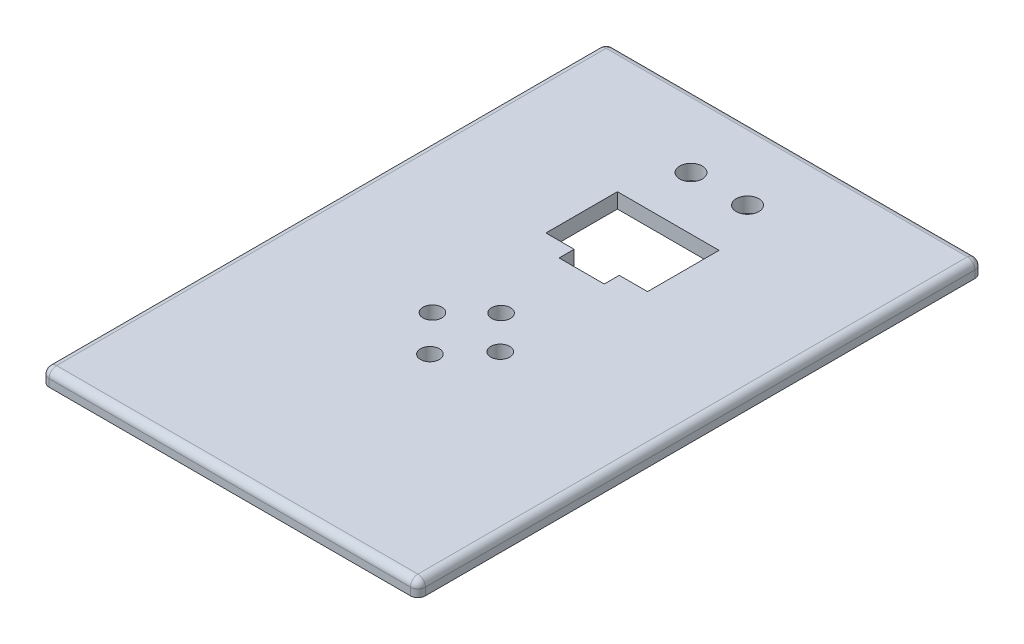
ISO-10303-21;
HEADER;
FILE_DESCRIPTION(('STEP AP214'),'2;1');
FILE_NAME('part.step','',(''),(''),'','','');
FILE_SCHEMA(('AUTOMOTIVE_DESIGN { 1 0 10303 214 1 1 1 1 }'));
ENDSEC;
DATA;
#1=APPLICATION_CONTEXT('core data for automotive mechanical design processes');
#2=APPLICATION_PROTOCOL_DEFINITION('international standard','automotive_design',2000,#1);
#3=PRODUCT_CONTEXT('',#1,'mechanical');
#4=PRODUCT('Part','Part','',(#3));
#5=PRODUCT_RELATED_PRODUCT_CATEGORY('part','',(#4));
#6=PRODUCT_DEFINITION_FORMATION('','',#4);
#7=PRODUCT_DEFINITION_CONTEXT('part definition',#1,'design');
#8=PRODUCT_DEFINITION('design','',#6,#7);
#9=PRODUCT_DEFINITION_SHAPE('','',#8);
#10=(LENGTH_UNIT() NAMED_UNIT(*) SI_UNIT(.MILLI.,.METRE.));
#11=(NAMED_UNIT(*) PLANE_ANGLE_UNIT() SI_UNIT($,.RADIAN.));
#12=(NAMED_UNIT(*) SI_UNIT($,.STERADIAN.) SOLID_ANGLE_UNIT());
#13=UNCERTAINTY_MEASURE_WITH_UNIT(LENGTH_MEASURE(1.E-05),#10,'distance_accuracy_value','');
#14=(GEOMETRIC_REPRESENTATION_CONTEXT(3) GLOBAL_UNCERTAINTY_ASSIGNED_CONTEXT((#13)) GLOBAL_UNIT_ASSIGNED_CONTEXT((#10,
#11,#12)) REPRESENTATION_CONTEXT('',''));
#15=CARTESIAN_POINT('',(0.,0.,0.));
#16=DIRECTION('',(0.,0.,1.));
#17=DIRECTION('',(1.,0.,0.));
#18=AXIS2_PLACEMENT_3D('',#15,#16,#17);
#19=CARTESIAN_POINT('',(0.,4.,0.));
#20=DIRECTION('',(0.,1.,0.));
#21=DIRECTION('',(0.,0.,1.));
#22=AXIS2_PLACEMENT_3D('',#19,#20,#21);
#23=PLANE('',#22);
#24=DIRECTION('',(0.,0.,-1.));
#25=VECTOR('',#24,1.);
#26=CARTESIAN_POINT('',(2.,4.,0.));
#27=LINE('',#26,#25);
#28=CARTESIAN_POINT('',(1.99999999999999,4.,-148.));
#29=VERTEX_POINT('',#28);
#30=CARTESIAN_POINT('',(2.,4.,-2.));
#31=VERTEX_POINT('',#30);
#32=EDGE_CURVE('E251',#29,#31,#27,.F.);
#33=ORIENTED_EDGE('',*,*,#32,.T.);
#34=DIRECTION('',(1.,0.,0.));
#35=VECTOR('',#34,1.);
#36=CARTESIAN_POINT('',(100.,4.,-2.));
#37=LINE('',#36,#35);
#38=CARTESIAN_POINT('',(98.,4.,-2.));
#39=VERTEX_POINT('',#38);
#40=EDGE_CURVE('E255',#31,#39,#37,.T.);
#41=ORIENTED_EDGE('',*,*,#40,.T.);
#42=DIRECTION('',(0.,0.,-1.));
#43=VECTOR('',#42,1.);
#44=CARTESIAN_POINT('',(98.,4.,-150.));
#45=LINE('',#44,#43);
#46=CARTESIAN_POINT('',(98.,4.,-148.));
#47=VERTEX_POINT('',#46);
#48=EDGE_CURVE('E253',#39,#47,#45,.T.);
#49=ORIENTED_EDGE('',*,*,#48,.T.);
#50=DIRECTION('',(1.,0.,0.));
#51=VECTOR('',#50,1.);
#52=CARTESIAN_POINT('',(0.,4.,-148.));
#53=LINE('',#52,#51);
#54=EDGE_CURVE('E249',#47,#29,#53,.F.);
#55=ORIENTED_EDGE('',*,*,#54,.T.);
#56=EDGE_LOOP('',(#33,#41,#49,#55));
#57=FACE_BOUND('',#56,.T.);
#58=CARTESIAN_POINT('',(56.881630687076,4.,-130.696209526068));
#59=DIRECTION('',(0.,1.,0.));
#60=DIRECTION('',(0.,0.,1.));
#61=AXIS2_PLACEMENT_3D('',#58,#59,#60);
#62=CIRCLE('',#61,3.);
#63=CARTESIAN_POINT('',(56.881630687076,4.,-127.696209526068));
#64=VERTEX_POINT('',#63);
#65=EDGE_CURVE('E310',#64,#64,#62,.T.);
#66=ORIENTED_EDGE('',*,*,#65,.F.);
#67=EDGE_LOOP('',(#66));
#68=FACE_BOUND('',#67,.T.);
#69=CARTESIAN_POINT('',(41.8690152605504,4.,-130.696209526068));
#70=DIRECTION('',(0.,1.,0.));
#71=DIRECTION('',(0.,0.,1.));
#72=AXIS2_PLACEMENT_3D('',#69,#70,#71);
#73=CIRCLE('',#72,3.);
#74=CARTESIAN_POINT('',(41.8690152605504,4.,-127.696209526068));
#75=VERTEX_POINT('',#74);
#76=EDGE_CURVE('E300',#75,#75,#73,.T.);
#77=ORIENTED_EDGE('',*,*,#76,.F.);
#78=EDGE_LOOP('',(#77));
#79=FACE_BOUND('',#78,.T.);
#80=CARTESIAN_POINT('',(48.9759493380895,4.,-73.1295101436644));
#81=DIRECTION('',(0.,1.,0.));
#82=DIRECTION('',(0.,0.,1.));
#83=AXIS2_PLACEMENT_3D('',#80,#81,#82);
#84=CIRCLE('',#83,2.5);
#85=CARTESIAN_POINT('',(48.9759493380895,4.,-70.6295101436644));
#86=VERTEX_POINT('',#85);
#87=EDGE_CURVE('E317',#86,#86,#84,.T.);
#88=ORIENTED_EDGE('',*,*,#87,.F.);
#89=EDGE_LOOP('',(#88));
#90=FACE_BOUND('',#89,.T.);
#91=CARTESIAN_POINT('',(48.9759493380895,4.,-54.2121558160821));
#92=DIRECTION('',(0.,1.,0.));
#93=DIRECTION('',(0.,0.,1.));
#94=AXIS2_PLACEMENT_3D('',#91,#92,#93);
#95=CIRCLE('',#94,2.5);
#96=CARTESIAN_POINT('',(48.9759493380895,4.,-51.7121558160821));
#97=VERTEX_POINT('',#96);
#98=EDGE_CURVE('E323',#97,#97,#95,.T.);
#99=ORIENTED_EDGE('',*,*,#98,.F.);
#100=EDGE_LOOP('',(#99));
#101=FACE_BOUND('',#100,.T.);
#102=CARTESIAN_POINT('',(57.7747187927789,4.,-64.1107714526077));
#103=DIRECTION('',(0.,1.,0.));
#104=DIRECTION('',(0.,0.,1.));
#105=AXIS2_PLACEMENT_3D('',#102,#103,#104);
#106=CIRCLE('',#105,2.5);
#107=CARTESIAN_POINT('',(57.7747187927789,4.,-61.6107714526077));
#108=VERTEX_POINT('',#107);
#109=EDGE_CURVE('E329',#108,#108,#106,.T.);
#110=ORIENTED_EDGE('',*,*,#109,.F.);
#111=EDGE_LOOP('',(#110));
#112=FACE_BOUND('',#111,.T.);
#113=CARTESIAN_POINT('',(39.7372414106655,4.,-64.1107714526077));
#114=DIRECTION('',(0.,1.,0.));
#115=DIRECTION('',(0.,0.,1.));
#116=AXIS2_PLACEMENT_3D('',#113,#114,#115);
#117=CIRCLE('',#116,2.5);
#118=CARTESIAN_POINT('',(39.7372414106655,4.,-61.6107714526077));
#119=VERTEX_POINT('',#118);
#120=EDGE_CURVE('E335',#119,#119,#117,.T.);
#121=ORIENTED_EDGE('',*,*,#120,.F.);
#122=EDGE_LOOP('',(#121));
#123=FACE_BOUND('',#122,.T.);
#124=DIRECTION('',(1.,0.,0.));
#125=VECTOR('',#124,1.);
#126=CARTESIAN_POINT('',(0.,4.,-97.5083981012169));
#127=LINE('',#126,#125);
#128=CARTESIAN_POINT('',(56.,4.,-97.5083981012169));
#129=VERTEX_POINT('',#128);
#130=CARTESIAN_POINT('',(63.5,4.,-97.5083981012169));
#131=VERTEX_POINT('',#130);
#132=EDGE_CURVE('E204',#129,#131,#127,.T.);
#133=ORIENTED_EDGE('',*,*,#132,.F.);
#134=DIRECTION('',(0.,0.,1.));
#135=VECTOR('',#134,1.);
#136=CARTESIAN_POINT('',(56.,4.,0.));
#137=LINE('',#136,#135);
#138=CARTESIAN_POINT('',(56.,4.,-93.5083981012169));
#139=VERTEX_POINT('',#138);
#140=EDGE_CURVE('E162',#129,#139,#137,.T.);
#141=ORIENTED_EDGE('',*,*,#140,.T.);
#142=DIRECTION('',(1.,0.,0.));
#143=VECTOR('',#142,1.);
#144=CARTESIAN_POINT('',(0.,4.,-93.5083981012169));
#145=LINE('',#144,#143);
#146=CARTESIAN_POINT('',(44.,4.,-93.5083981012169));
#147=VERTEX_POINT('',#146);
#148=EDGE_CURVE('E178',#147,#139,#145,.T.);
#149=ORIENTED_EDGE('',*,*,#148,.F.);
#150=DIRECTION('',(0.,0.,1.));
#151=VECTOR('',#150,1.);
#152=CARTESIAN_POINT('',(44.0000000000002,4.,0.));
#153=LINE('',#152,#151);
#154=CARTESIAN_POINT('',(44.,4.,-97.5083981012169));
#155=VERTEX_POINT('',#154);
#156=EDGE_CURVE('E342',#155,#147,#153,.T.);
#157=ORIENTED_EDGE('',*,*,#156,.F.);
#158=CARTESIAN_POINT('',(36.5,4.,-97.5083981012169));
#159=VERTEX_POINT('',#158);
#160=EDGE_CURVE('E205',#159,#155,#127,.T.);
#161=ORIENTED_EDGE('',*,*,#160,.F.);
#162=DIRECTION('',(0.,0.,1.));
#163=VECTOR('',#162,1.);
#164=CARTESIAN_POINT('',(36.5,4.,0.));
#165=LINE('',#164,#163);
#166=CARTESIAN_POINT('',(36.5,4.,-116.508398101217));
#167=VERTEX_POINT('',#166);
#168=EDGE_CURVE('E201',#167,#159,#165,.T.);
#169=ORIENTED_EDGE('',*,*,#168,.F.);
#170=DIRECTION('',(1.,0.,0.));
#171=VECTOR('',#170,1.);
#172=CARTESIAN_POINT('',(0.,4.,-116.508398101217));
#173=LINE('',#172,#171);
#174=CARTESIAN_POINT('',(63.5,4.,-116.508398101217));
#175=VERTEX_POINT('',#174);
#176=EDGE_CURVE('E197',#167,#175,#173,.T.);
#177=ORIENTED_EDGE('',*,*,#176,.T.);
#178=DIRECTION('',(0.,0.,1.));
#179=VECTOR('',#178,1.);
#180=CARTESIAN_POINT('',(63.5,4.,0.));
#181=LINE('',#180,#179);
#182=EDGE_CURVE('E194',#175,#131,#181,.T.);
#183=ORIENTED_EDGE('',*,*,#182,.T.);
#184=EDGE_LOOP('',(#133,#141,#149,#157,#161,#169,#177,#183));
#185=FACE_BOUND('',#184,.T.);
#186=ADVANCED_FACE('F33',(#57,#68,#79,#90,#101,#112,#123,#185),#23,.T.);
#187=CARTESIAN_POINT('',(0.,0.,0.));
#188=DIRECTION('',(0.,1.,0.));
#189=DIRECTION('',(0.,0.,1.));
#190=AXIS2_PLACEMENT_3D('',#187,#188,#189);
#191=PLANE('',#190);
#192=CARTESIAN_POINT('',(56.881630687076,0.,-130.696209526068));
#193=DIRECTION('',(0.,1.,0.));
#194=DIRECTION('',(0.,0.,1.));
#195=AXIS2_PLACEMENT_3D('',#192,#193,#194);
#196=CIRCLE('',#195,3.);
#197=CARTESIAN_POINT('',(56.881630687076,0.,-127.696209526068));
#198=VERTEX_POINT('',#197);
#199=EDGE_CURVE('E337',#198,#198,#196,.T.);
#200=ORIENTED_EDGE('',*,*,#199,.T.);
#201=EDGE_LOOP('',(#200));
#202=FACE_BOUND('',#201,.T.);
#203=CARTESIAN_POINT('',(41.8690152605504,0.,-130.696209526068));
#204=DIRECTION('',(0.,1.,0.));
#205=DIRECTION('',(0.,0.,1.));
#206=AXIS2_PLACEMENT_3D('',#203,#204,#205);
#207=CIRCLE('',#206,3.);
#208=CARTESIAN_POINT('',(41.8690152605504,0.,-127.696209526068));
#209=VERTEX_POINT('',#208);
#210=EDGE_CURVE('E305',#209,#209,#207,.T.);
#211=ORIENTED_EDGE('',*,*,#210,.T.);
#212=EDGE_LOOP('',(#211));
#213=FACE_BOUND('',#212,.T.);
#214=CARTESIAN_POINT('',(48.9759493380895,0.,-73.1295101436644));
#215=DIRECTION('',(0.,1.,0.));
#216=DIRECTION('',(0.,0.,1.));
#217=AXIS2_PLACEMENT_3D('',#214,#215,#216);
#218=CIRCLE('',#217,2.5);
#219=CARTESIAN_POINT('',(48.9759493380895,0.,-70.6295101436644));
#220=VERTEX_POINT('',#219);
#221=EDGE_CURVE('E314',#220,#220,#218,.T.);
#222=ORIENTED_EDGE('',*,*,#221,.T.);
#223=EDGE_LOOP('',(#222));
#224=FACE_BOUND('',#223,.T.);
#225=CARTESIAN_POINT('',(48.9759493380895,0.,-54.2121558160821));
#226=DIRECTION('',(0.,1.,0.));
#227=DIRECTION('',(0.,0.,1.));
#228=AXIS2_PLACEMENT_3D('',#225,#226,#227);
#229=CIRCLE('',#228,2.5);
#230=CARTESIAN_POINT('',(48.9759493380895,0.,-51.7121558160821));
#231=VERTEX_POINT('',#230);
#232=EDGE_CURVE('E320',#231,#231,#229,.T.);
#233=ORIENTED_EDGE('',*,*,#232,.T.);
#234=EDGE_LOOP('',(#233));
#235=FACE_BOUND('',#234,.T.);
#236=CARTESIAN_POINT('',(57.7747187927789,0.,-64.1107714526077));
#237=DIRECTION('',(0.,1.,0.));
#238=DIRECTION('',(0.,0.,1.));
#239=AXIS2_PLACEMENT_3D('',#236,#237,#238);
#240=CIRCLE('',#239,2.5);
#241=CARTESIAN_POINT('',(57.7747187927789,0.,-61.6107714526077));
#242=VERTEX_POINT('',#241);
#243=EDGE_CURVE('E326',#242,#242,#240,.T.);
#244=ORIENTED_EDGE('',*,*,#243,.T.);
#245=EDGE_LOOP('',(#244));
#246=FACE_BOUND('',#245,.T.);
#247=CARTESIAN_POINT('',(39.7372414106655,0.,-64.1107714526077));
#248=DIRECTION('',(0.,1.,0.));
#249=DIRECTION('',(0.,0.,1.));
#250=AXIS2_PLACEMENT_3D('',#247,#248,#249);
#251=CIRCLE('',#250,2.5);
#252=CARTESIAN_POINT('',(39.7372414106655,0.,-61.6107714526077));
#253=VERTEX_POINT('',#252);
#254=EDGE_CURVE('E332',#253,#253,#251,.T.);
#255=ORIENTED_EDGE('',*,*,#254,.T.);
#256=EDGE_LOOP('',(#255));
#257=FACE_BOUND('',#256,.T.);
#258=DIRECTION('',(1.,0.,0.));
#259=VECTOR('',#258,1.);
#260=CARTESIAN_POINT('',(0.,0.,0.));
#261=LINE('',#260,#259);
#262=CARTESIAN_POINT('',(2.,0.,0.));
#263=VERTEX_POINT('',#262);
#264=CARTESIAN_POINT('',(98.,0.,0.));
#265=VERTEX_POINT('',#264);
#266=EDGE_CURVE('E222',#263,#265,#261,.T.);
#267=ORIENTED_EDGE('',*,*,#266,.F.);
#268=CARTESIAN_POINT('',(2.,0.,-2.));
#269=DIRECTION('',(0.,1.,0.));
#270=DIRECTION('',(0.,0.,1.));
#271=AXIS2_PLACEMENT_3D('',#268,#269,#270);
#272=CIRCLE('',#271,2.);
#273=CARTESIAN_POINT('',(0.,0.,-2.));
#274=VERTEX_POINT('',#273);
#275=EDGE_CURVE('E241',#263,#274,#272,.F.);
#276=ORIENTED_EDGE('',*,*,#275,.T.);
#277=DIRECTION('',(0.,0.,-1.));
#278=VECTOR('',#277,1.);
#279=CARTESIAN_POINT('',(0.,0.,0.));
#280=LINE('',#279,#278);
#281=CARTESIAN_POINT('',(0.,0.,-148.));
#282=VERTEX_POINT('',#281);
#283=EDGE_CURVE('E225',#274,#282,#280,.T.);
#284=ORIENTED_EDGE('',*,*,#283,.T.);
#285=CARTESIAN_POINT('',(1.99999999999999,0.,-148.));
#286=DIRECTION('',(0.,1.,0.));
#287=DIRECTION('',(0.,0.,1.));
#288=AXIS2_PLACEMENT_3D('',#285,#286,#287);
#289=CIRCLE('',#288,2.);
#290=CARTESIAN_POINT('',(1.99999999999999,0.,-150.));
#291=VERTEX_POINT('',#290);
#292=EDGE_CURVE('E235',#282,#291,#289,.F.);
#293=ORIENTED_EDGE('',*,*,#292,.T.);
#294=DIRECTION('',(1.,0.,0.));
#295=VECTOR('',#294,1.);
#296=CARTESIAN_POINT('',(0.,0.,-150.));
#297=LINE('',#296,#295);
#298=CARTESIAN_POINT('',(97.9999999999999,0.,-150.));
#299=VERTEX_POINT('',#298);
#300=EDGE_CURVE('E210',#291,#299,#297,.T.);
#301=ORIENTED_EDGE('',*,*,#300,.T.);
#302=CARTESIAN_POINT('',(98.,0.,-148.));
#303=DIRECTION('',(0.,1.,0.));
#304=DIRECTION('',(0.,0.,1.));
#305=AXIS2_PLACEMENT_3D('',#302,#303,#304);
#306=CIRCLE('',#305,2.);
#307=CARTESIAN_POINT('',(100.,0.,-148.));
#308=VERTEX_POINT('',#307);
#309=EDGE_CURVE('E237',#299,#308,#306,.F.);
#310=ORIENTED_EDGE('',*,*,#309,.T.);
#311=DIRECTION('',(0.,0.,-1.));
#312=VECTOR('',#311,1.);
#313=CARTESIAN_POINT('',(100.,0.,0.));
#314=LINE('',#313,#312);
#315=CARTESIAN_POINT('',(100.,0.,-2.));
#316=VERTEX_POINT('',#315);
#317=EDGE_CURVE('E219',#316,#308,#314,.T.);
#318=ORIENTED_EDGE('',*,*,#317,.F.);
#319=CARTESIAN_POINT('',(98.,0.,-2.));
#320=DIRECTION('',(0.,1.,0.));
#321=DIRECTION('',(0.,0.,1.));
#322=AXIS2_PLACEMENT_3D('',#319,#320,#321);
#323=CIRCLE('',#322,2.);
#324=EDGE_CURVE('E239',#316,#265,#323,.F.);
#325=ORIENTED_EDGE('',*,*,#324,.T.);
#326=EDGE_LOOP('',(#267,#276,#284,#293,#301,#310,#318,#325));
#327=FACE_BOUND('',#326,.T.);
#328=DIRECTION('',(0.,0.,1.));
#329=VECTOR('',#328,1.);
#330=CARTESIAN_POINT('',(56.,0.,0.));
#331=LINE('',#330,#329);
#332=CARTESIAN_POINT('',(56.,0.,-97.5083981012169));
#333=VERTEX_POINT('',#332);
#334=CARTESIAN_POINT('',(56.,0.,-93.5083981012169));
#335=VERTEX_POINT('',#334);
#336=EDGE_CURVE('E159',#333,#335,#331,.T.);
#337=ORIENTED_EDGE('',*,*,#336,.F.);
#338=DIRECTION('',(1.,0.,0.));
#339=VECTOR('',#338,1.);
#340=CARTESIAN_POINT('',(0.,0.,-97.5083981012169));
#341=LINE('',#340,#339);
#342=CARTESIAN_POINT('',(63.5,0.,-97.5083981012169));
#343=VERTEX_POINT('',#342);
#344=EDGE_CURVE('E173',#333,#343,#341,.T.);
#345=ORIENTED_EDGE('',*,*,#344,.T.);
#346=DIRECTION('',(0.,0.,1.));
#347=VECTOR('',#346,1.);
#348=CARTESIAN_POINT('',(63.5,0.,0.));
#349=LINE('',#348,#347);
#350=CARTESIAN_POINT('',(63.5,0.,-116.508398101217));
#351=VERTEX_POINT('',#350);
#352=EDGE_CURVE('E208',#351,#343,#349,.T.);
#353=ORIENTED_EDGE('',*,*,#352,.F.);
#354=DIRECTION('',(1.,0.,0.));
#355=VECTOR('',#354,1.);
#356=CARTESIAN_POINT('',(0.,0.,-116.508398101217));
#357=LINE('',#356,#355);
#358=CARTESIAN_POINT('',(36.5,0.,-116.508398101217));
#359=VERTEX_POINT('',#358);
#360=EDGE_CURVE('E190',#359,#351,#357,.T.);
#361=ORIENTED_EDGE('',*,*,#360,.F.);
#362=DIRECTION('',(0.,0.,1.));
#363=VECTOR('',#362,1.);
#364=CARTESIAN_POINT('',(36.5,0.,0.));
#365=LINE('',#364,#363);
#366=CARTESIAN_POINT('',(36.5,0.,-97.5083981012169));
#367=VERTEX_POINT('',#366);
#368=EDGE_CURVE('E185',#359,#367,#365,.T.);
#369=ORIENTED_EDGE('',*,*,#368,.T.);
#370=CARTESIAN_POINT('',(44.,0.,-97.5083981012169));
#371=VERTEX_POINT('',#370);
#372=EDGE_CURVE('E184',#367,#371,#341,.T.);
#373=ORIENTED_EDGE('',*,*,#372,.T.);
#374=DIRECTION('',(0.,0.,1.));
#375=VECTOR('',#374,1.);
#376=CARTESIAN_POINT('',(44.0000000000002,0.,0.));
#377=LINE('',#376,#375);
#378=CARTESIAN_POINT('',(44.,0.,-93.5083981012169));
#379=VERTEX_POINT('',#378);
#380=EDGE_CURVE('E177',#371,#379,#377,.T.);
#381=ORIENTED_EDGE('',*,*,#380,.T.);
#382=DIRECTION('',(1.,0.,0.));
#383=VECTOR('',#382,1.);
#384=CARTESIAN_POINT('',(0.,0.,-93.5083981012169));
#385=LINE('',#384,#383);
#386=EDGE_CURVE('E167',#379,#335,#385,.T.);
#387=ORIENTED_EDGE('',*,*,#386,.T.);
#388=EDGE_LOOP('',(#337,#345,#353,#361,#369,#373,#381,#387));
#389=FACE_BOUND('',#388,.T.);
#390=ADVANCED_FACE('F171',(#202,#213,#224,#235,#246,#257,#327,#389),#191,.F.);
#391=CARTESIAN_POINT('',(0.,0.,-97.5083981012169));
#392=DIRECTION('',(0.,0.,1.));
#393=DIRECTION('',(1.,0.,0.));
#394=AXIS2_PLACEMENT_3D('',#391,#392,#393);
#395=PLANE('',#394);
#396=DIRECTION('',(0.,1.,0.));
#397=VECTOR('',#396,1.);
#398=CARTESIAN_POINT('',(56.,0.,-97.5083981012169));
#399=LINE('',#398,#397);
#400=EDGE_CURVE('E156',#333,#129,#399,.T.);
#401=ORIENTED_EDGE('',*,*,#400,.T.);
#402=ORIENTED_EDGE('',*,*,#132,.T.);
#403=DIRECTION('',(0.,1.,0.));
#404=VECTOR('',#403,1.);
#405=CARTESIAN_POINT('',(63.5,0.,-97.5083981012169));
#406=LINE('',#405,#404);
#407=EDGE_CURVE('E183',#343,#131,#406,.T.);
#408=ORIENTED_EDGE('',*,*,#407,.F.);
#409=ORIENTED_EDGE('',*,*,#344,.F.);
#410=EDGE_LOOP('',(#401,#402,#408,#409));
#411=FACE_BOUND('',#410,.T.);
#412=ADVANCED_FACE('F181',(#411),#395,.F.);
#413=CARTESIAN_POINT('',(0.,4.,-150.));
#414=DIRECTION('',(0.,0.,-1.));
#415=DIRECTION('',(-1.,0.,0.));
#416=AXIS2_PLACEMENT_3D('',#413,#414,#415);
#417=PLANE('',#416);
#418=DIRECTION('',(1.,0.,0.));
#419=VECTOR('',#418,1.);
#420=CARTESIAN_POINT('',(0.,2.,-150.));
#421=LINE('',#420,#419);
#422=CARTESIAN_POINT('',(1.99999999999999,2.,-150.));
#423=VERTEX_POINT('',#422);
#424=CARTESIAN_POINT('',(98.,2.,-150.));
#425=VERTEX_POINT('',#424);
#426=EDGE_CURVE('E49',#423,#425,#421,.T.);
#427=ORIENTED_EDGE('',*,*,#426,.T.);
#428=DIRECTION('',(0.,-1.,0.));
#429=VECTOR('',#428,1.);
#430=CARTESIAN_POINT('',(98.,0.,-150.));
#431=LINE('',#430,#429);
#432=EDGE_CURVE('E11',#425,#299,#431,.T.);
#433=ORIENTED_EDGE('',*,*,#432,.T.);
#434=ORIENTED_EDGE('',*,*,#300,.F.);
#435=DIRECTION('',(0.,-1.,0.));
#436=VECTOR('',#435,1.);
#437=CARTESIAN_POINT('',(1.99999999999999,4.,-150.));
#438=LINE('',#437,#436);
#439=EDGE_CURVE('E42',#291,#423,#438,.F.);
#440=ORIENTED_EDGE('',*,*,#439,.T.);
#441=EDGE_LOOP('',(#427,#433,#434,#440));
#442=FACE_BOUND('',#441,.T.);
#443=ADVANCED_FACE('F401',(#442),#417,.T.);
#444=CARTESIAN_POINT('',(0.,4.,0.));
#445=DIRECTION('',(-1.,0.,0.));
#446=DIRECTION('',(0.,0.,1.));
#447=AXIS2_PLACEMENT_3D('',#444,#445,#446);
#448=PLANE('',#447);
#449=ORIENTED_EDGE('',*,*,#283,.F.);
#450=DIRECTION('',(0.,-1.,0.));
#451=VECTOR('',#450,1.);
#452=CARTESIAN_POINT('',(0.,4.,-2.));
#453=LINE('',#452,#451);
#454=CARTESIAN_POINT('',(0.,2.,-2.));
#455=VERTEX_POINT('',#454);
#456=EDGE_CURVE('E247',#274,#455,#453,.F.);
#457=ORIENTED_EDGE('',*,*,#456,.T.);
#458=DIRECTION('',(0.,0.,-1.));
#459=VECTOR('',#458,1.);
#460=CARTESIAN_POINT('',(0.,2.,0.));
#461=LINE('',#460,#459);
#462=CARTESIAN_POINT('',(0.,2.,-148.));
#463=VERTEX_POINT('',#462);
#464=EDGE_CURVE('E243',#455,#463,#461,.T.);
#465=ORIENTED_EDGE('',*,*,#464,.T.);
#466=DIRECTION('',(0.,-1.,0.));
#467=VECTOR('',#466,1.);
#468=CARTESIAN_POINT('',(0.,4.,-148.));
#469=LINE('',#468,#467);
#470=EDGE_CURVE('E245',#463,#282,#469,.T.);
#471=ORIENTED_EDGE('',*,*,#470,.T.);
#472=EDGE_LOOP('',(#449,#457,#465,#471));
#473=FACE_BOUND('',#472,.T.);
#474=ADVANCED_FACE('F397',(#473),#448,.T.);
#475=CARTESIAN_POINT('',(0.,4.,0.));
#476=DIRECTION('',(0.,0.,-1.));
#477=DIRECTION('',(-1.,0.,0.));
#478=AXIS2_PLACEMENT_3D('',#475,#476,#477);
#479=PLANE('',#478);
#480=DIRECTION('',(1.,0.,0.));
#481=VECTOR('',#480,1.);
#482=CARTESIAN_POINT('',(0.,2.,0.));
#483=LINE('',#482,#481);
#484=CARTESIAN_POINT('',(98.,2.,0.));
#485=VERTEX_POINT('',#484);
#486=CARTESIAN_POINT('',(2.,2.,0.));
#487=VERTEX_POINT('',#486);
#488=EDGE_CURVE('E230',#485,#487,#483,.F.);
#489=ORIENTED_EDGE('',*,*,#488,.T.);
#490=DIRECTION('',(0.,-1.,0.));
#491=VECTOR('',#490,1.);
#492=CARTESIAN_POINT('',(2.,0.,0.));
#493=LINE('',#492,#491);
#494=EDGE_CURVE('E232',#487,#263,#493,.T.);
#495=ORIENTED_EDGE('',*,*,#494,.T.);
#496=ORIENTED_EDGE('',*,*,#266,.T.);
#497=DIRECTION('',(0.,-1.,0.));
#498=VECTOR('',#497,1.);
#499=CARTESIAN_POINT('',(98.,4.,0.));
#500=LINE('',#499,#498);
#501=EDGE_CURVE('E228',#265,#485,#500,.F.);
#502=ORIENTED_EDGE('',*,*,#501,.T.);
#503=EDGE_LOOP('',(#489,#495,#496,#502));
#504=FACE_BOUND('',#503,.T.);
#505=ADVANCED_FACE('F400',(#504),#479,.F.);
#506=CARTESIAN_POINT('',(100.,4.,0.));
#507=DIRECTION('',(-1.,0.,0.));
#508=DIRECTION('',(0.,0.,1.));
#509=AXIS2_PLACEMENT_3D('',#506,#507,#508);
#510=PLANE('',#509);
#511=DIRECTION('',(0.,0.,-1.));
#512=VECTOR('',#511,1.);
#513=CARTESIAN_POINT('',(100.,2.,0.));
#514=LINE('',#513,#512);
#515=CARTESIAN_POINT('',(100.,2.,-148.));
#516=VERTEX_POINT('',#515);
#517=CARTESIAN_POINT('',(100.,2.,-2.));
#518=VERTEX_POINT('',#517);
#519=EDGE_CURVE('E260',#516,#518,#514,.F.);
#520=ORIENTED_EDGE('',*,*,#519,.T.);
#521=DIRECTION('',(0.,-1.,0.));
#522=VECTOR('',#521,1.);
#523=CARTESIAN_POINT('',(100.,4.,-2.));
#524=LINE('',#523,#522);
#525=EDGE_CURVE('E262',#518,#316,#524,.T.);
#526=ORIENTED_EDGE('',*,*,#525,.T.);
#527=ORIENTED_EDGE('',*,*,#317,.T.);
#528=DIRECTION('',(0.,-1.,0.));
#529=VECTOR('',#528,1.);
#530=CARTESIAN_POINT('',(100.,4.,-148.));
#531=LINE('',#530,#529);
#532=EDGE_CURVE('E258',#308,#516,#531,.F.);
#533=ORIENTED_EDGE('',*,*,#532,.T.);
#534=EDGE_LOOP('',(#520,#526,#527,#533));
#535=FACE_BOUND('',#534,.T.);
#536=ADVANCED_FACE('F405',(#535),#510,.F.);
#537=CARTESIAN_POINT('',(63.5,0.,0.));
#538=DIRECTION('',(-1.,0.,0.));
#539=DIRECTION('',(0.,0.,1.));
#540=AXIS2_PLACEMENT_3D('',#537,#538,#539);
#541=PLANE('',#540);
#542=ORIENTED_EDGE('',*,*,#182,.F.);
#543=DIRECTION('',(0.,1.,0.));
#544=VECTOR('',#543,1.);
#545=CARTESIAN_POINT('',(63.5,0.,-116.508398101217));
#546=LINE('',#545,#544);
#547=EDGE_CURVE('E188',#351,#175,#546,.T.);
#548=ORIENTED_EDGE('',*,*,#547,.F.);
#549=ORIENTED_EDGE('',*,*,#352,.T.);
#550=ORIENTED_EDGE('',*,*,#407,.T.);
#551=EDGE_LOOP('',(#542,#548,#549,#550));
#552=FACE_BOUND('',#551,.T.);
#553=ADVANCED_FACE('F358',(#552),#541,.T.);
#554=ORIENTED_EDGE('',*,*,#160,.T.);
#555=DIRECTION('',(0.,1.,0.));
#556=VECTOR('',#555,1.);
#557=CARTESIAN_POINT('',(44.,0.,-97.5083981012169));
#558=LINE('',#557,#556);
#559=EDGE_CURVE('E166',#371,#155,#558,.T.);
#560=ORIENTED_EDGE('',*,*,#559,.F.);
#561=ORIENTED_EDGE('',*,*,#372,.F.);
#562=DIRECTION('',(0.,1.,0.));
#563=VECTOR('',#562,1.);
#564=CARTESIAN_POINT('',(36.5,0.,-97.5083981012169));
#565=LINE('',#564,#563);
#566=EDGE_CURVE('E211',#367,#159,#565,.T.);
#567=ORIENTED_EDGE('',*,*,#566,.T.);
#568=EDGE_LOOP('',(#554,#560,#561,#567));
#569=FACE_BOUND('',#568,.T.);
#570=ADVANCED_FACE('F368',(#569),#395,.F.);
#571=CARTESIAN_POINT('',(36.5,0.,0.));
#572=DIRECTION('',(-1.,0.,0.));
#573=DIRECTION('',(0.,0.,1.));
#574=AXIS2_PLACEMENT_3D('',#571,#572,#573);
#575=PLANE('',#574);
#576=ORIENTED_EDGE('',*,*,#168,.T.);
#577=ORIENTED_EDGE('',*,*,#566,.F.);
#578=ORIENTED_EDGE('',*,*,#368,.F.);
#579=DIRECTION('',(0.,1.,0.));
#580=VECTOR('',#579,1.);
#581=CARTESIAN_POINT('',(36.5,0.,-116.508398101217));
#582=LINE('',#581,#580);
#583=EDGE_CURVE('E213',#359,#167,#582,.T.);
#584=ORIENTED_EDGE('',*,*,#583,.T.);
#585=EDGE_LOOP('',(#576,#577,#578,#584));
#586=FACE_BOUND('',#585,.T.);
#587=ADVANCED_FACE('F364',(#586),#575,.F.);
#588=CARTESIAN_POINT('',(0.,0.,-116.508398101217));
#589=DIRECTION('',(0.,0.,1.));
#590=DIRECTION('',(1.,0.,0.));
#591=AXIS2_PLACEMENT_3D('',#588,#589,#590);
#592=PLANE('',#591);
#593=ORIENTED_EDGE('',*,*,#176,.F.);
#594=ORIENTED_EDGE('',*,*,#583,.F.);
#595=ORIENTED_EDGE('',*,*,#360,.T.);
#596=ORIENTED_EDGE('',*,*,#547,.T.);
#597=EDGE_LOOP('',(#593,#594,#595,#596));
#598=FACE_BOUND('',#597,.T.);
#599=ADVANCED_FACE('F356',(#598),#592,.T.);
#600=CARTESIAN_POINT('',(56.,0.,0.));
#601=DIRECTION('',(-1.,0.,0.));
#602=DIRECTION('',(0.,0.,1.));
#603=AXIS2_PLACEMENT_3D('',#600,#601,#602);
#604=PLANE('',#603);
#605=ORIENTED_EDGE('',*,*,#140,.F.);
#606=ORIENTED_EDGE('',*,*,#400,.F.);
#607=ORIENTED_EDGE('',*,*,#336,.T.);
#608=DIRECTION('',(0.,1.,0.));
#609=VECTOR('',#608,1.);
#610=CARTESIAN_POINT('',(56.,0.,-93.5083981012169));
#611=LINE('',#610,#609);
#612=EDGE_CURVE('E198',#335,#139,#611,.T.);
#613=ORIENTED_EDGE('',*,*,#612,.T.);
#614=EDGE_LOOP('',(#605,#606,#607,#613));
#615=FACE_BOUND('',#614,.T.);
#616=ADVANCED_FACE('F158',(#615),#604,.T.);
#617=CARTESIAN_POINT('',(0.,0.,-93.5083981012169));
#618=DIRECTION('',(0.,0.,1.));
#619=DIRECTION('',(1.,0.,0.));
#620=AXIS2_PLACEMENT_3D('',#617,#618,#619);
#621=PLANE('',#620);
#622=ORIENTED_EDGE('',*,*,#148,.T.);
#623=ORIENTED_EDGE('',*,*,#612,.F.);
#624=ORIENTED_EDGE('',*,*,#386,.F.);
#625=DIRECTION('',(0.,1.,0.));
#626=VECTOR('',#625,1.);
#627=CARTESIAN_POINT('',(44.,0.,-93.5083981012169));
#628=LINE('',#627,#626);
#629=EDGE_CURVE('E348',#379,#147,#628,.T.);
#630=ORIENTED_EDGE('',*,*,#629,.T.);
#631=EDGE_LOOP('',(#622,#623,#624,#630));
#632=FACE_BOUND('',#631,.T.);
#633=ADVANCED_FACE('F373',(#632),#621,.F.);
#634=CARTESIAN_POINT('',(44.0000000000002,0.,0.));
#635=DIRECTION('',(-1.,0.,0.));
#636=DIRECTION('',(0.,0.,1.));
#637=AXIS2_PLACEMENT_3D('',#634,#635,#636);
#638=PLANE('',#637);
#639=ORIENTED_EDGE('',*,*,#156,.T.);
#640=ORIENTED_EDGE('',*,*,#629,.F.);
#641=ORIENTED_EDGE('',*,*,#380,.F.);
#642=ORIENTED_EDGE('',*,*,#559,.T.);
#643=EDGE_LOOP('',(#639,#640,#641,#642));
#644=FACE_BOUND('',#643,.T.);
#645=ADVANCED_FACE('F370',(#644),#638,.F.);
#646=CARTESIAN_POINT('',(39.7372414106655,0.,-64.1107714526077));
#647=DIRECTION('',(0.,1.,0.));
#648=DIRECTION('',(0.,0.,1.));
#649=AXIS2_PLACEMENT_3D('',#646,#647,#648);
#650=CYLINDRICAL_SURFACE('',#649,2.5);
#651=ORIENTED_EDGE('',*,*,#254,.F.);
#652=EDGE_LOOP('',(#651));
#653=FACE_BOUND('',#652,.T.);
#654=ORIENTED_EDGE('',*,*,#120,.T.);
#655=EDGE_LOOP('',(#654));
#656=FACE_BOUND('',#655,.T.);
#657=ADVANCED_FACE('F380',(#653,#656),#650,.F.);
#658=CARTESIAN_POINT('',(57.7747187927789,0.,-64.1107714526077));
#659=DIRECTION('',(0.,1.,0.));
#660=DIRECTION('',(0.,0.,1.));
#661=AXIS2_PLACEMENT_3D('',#658,#659,#660);
#662=CYLINDRICAL_SURFACE('',#661,2.5);
#663=ORIENTED_EDGE('',*,*,#243,.F.);
#664=EDGE_LOOP('',(#663));
#665=FACE_BOUND('',#664,.T.);
#666=ORIENTED_EDGE('',*,*,#109,.T.);
#667=EDGE_LOOP('',(#666));
#668=FACE_BOUND('',#667,.T.);
#669=ADVANCED_FACE('F505',(#665,#668),#662,.F.);
#670=CARTESIAN_POINT('',(48.9759493380895,0.,-54.2121558160821));
#671=DIRECTION('',(0.,1.,0.));
#672=DIRECTION('',(0.,0.,1.));
#673=AXIS2_PLACEMENT_3D('',#670,#671,#672);
#674=CYLINDRICAL_SURFACE('',#673,2.5);
#675=ORIENTED_EDGE('',*,*,#232,.F.);
#676=EDGE_LOOP('',(#675));
#677=FACE_BOUND('',#676,.T.);
#678=ORIENTED_EDGE('',*,*,#98,.T.);
#679=EDGE_LOOP('',(#678));
#680=FACE_BOUND('',#679,.T.);
#681=ADVANCED_FACE('F501',(#677,#680),#674,.F.);
#682=CARTESIAN_POINT('',(48.9759493380895,0.,-73.1295101436644));
#683=DIRECTION('',(0.,1.,0.));
#684=DIRECTION('',(0.,0.,1.));
#685=AXIS2_PLACEMENT_3D('',#682,#683,#684);
#686=CYLINDRICAL_SURFACE('',#685,2.5);
#687=ORIENTED_EDGE('',*,*,#221,.F.);
#688=EDGE_LOOP('',(#687));
#689=FACE_BOUND('',#688,.T.);
#690=ORIENTED_EDGE('',*,*,#87,.T.);
#691=EDGE_LOOP('',(#690));
#692=FACE_BOUND('',#691,.T.);
#693=ADVANCED_FACE('F493',(#689,#692),#686,.F.);
#694=CARTESIAN_POINT('',(41.8690152605504,0.,-130.696209526068));
#695=DIRECTION('',(0.,1.,0.));
#696=DIRECTION('',(0.,0.,1.));
#697=AXIS2_PLACEMENT_3D('',#694,#695,#696);
#698=CYLINDRICAL_SURFACE('',#697,3.);
#699=ORIENTED_EDGE('',*,*,#210,.F.);
#700=EDGE_LOOP('',(#699));
#701=FACE_BOUND('',#700,.T.);
#702=ORIENTED_EDGE('',*,*,#76,.T.);
#703=EDGE_LOOP('',(#702));
#704=FACE_BOUND('',#703,.T.);
#705=ADVANCED_FACE('F488',(#701,#704),#698,.F.);
#706=CARTESIAN_POINT('',(56.881630687076,0.,-130.696209526068));
#707=DIRECTION('',(0.,1.,0.));
#708=DIRECTION('',(0.,0.,1.));
#709=AXIS2_PLACEMENT_3D('',#706,#707,#708);
#710=CYLINDRICAL_SURFACE('',#709,3.);
#711=ORIENTED_EDGE('',*,*,#199,.F.);
#712=EDGE_LOOP('',(#711));
#713=FACE_BOUND('',#712,.T.);
#714=ORIENTED_EDGE('',*,*,#65,.T.);
#715=EDGE_LOOP('',(#714));
#716=FACE_BOUND('',#715,.T.);
#717=ADVANCED_FACE('F455',(#713,#716),#710,.F.);
#718=CARTESIAN_POINT('',(98.,4.,-148.));
#719=DIRECTION('',(0.,1.,0.));
#720=DIRECTION('',(0.,0.,1.));
#721=AXIS2_PLACEMENT_3D('',#718,#719,#720);
#722=CYLINDRICAL_SURFACE('',#721,2.);
#723=CARTESIAN_POINT('',(98.,2.,-148.));
#724=DIRECTION('',(0.,1.,0.));
#725=DIRECTION('',(0.,0.,1.));
#726=AXIS2_PLACEMENT_3D('',#723,#724,#725);
#727=CIRCLE('',#726,2.);
#728=EDGE_CURVE('E37',#516,#425,#727,.T.);
#729=ORIENTED_EDGE('',*,*,#728,.F.);
#730=ORIENTED_EDGE('',*,*,#532,.F.);
#731=ORIENTED_EDGE('',*,*,#309,.F.);
#732=ORIENTED_EDGE('',*,*,#432,.F.);
#733=EDGE_LOOP('',(#729,#730,#731,#732));
#734=FACE_BOUND('',#733,.T.);
#735=ADVANCED_FACE('F35',(#734),#722,.T.);
#736=CARTESIAN_POINT('',(98.,2.,-148.));
#737=DIRECTION('',(0.,0.,1.));
#738=DIRECTION('',(1.,0.,0.));
#739=AXIS2_PLACEMENT_3D('',#736,#737,#738);
#740=SPHERICAL_SURFACE('',#739,2.);
#741=CARTESIAN_POINT('',(98.,2.,-148.));
#742=DIRECTION('',(0.,0.,-1.));
#743=DIRECTION('',(-1.,0.,0.));
#744=AXIS2_PLACEMENT_3D('',#741,#742,#743);
#745=CIRCLE('',#744,2.);
#746=EDGE_CURVE('E292',#516,#47,#745,.F.);
#747=ORIENTED_EDGE('',*,*,#746,.F.);
#748=ORIENTED_EDGE('',*,*,#728,.T.);
#749=CARTESIAN_POINT('',(98.,2.,-148.));
#750=DIRECTION('',(1.,0.,0.));
#751=DIRECTION('',(0.,0.,-1.));
#752=AXIS2_PLACEMENT_3D('',#749,#750,#751);
#753=CIRCLE('',#752,2.);
#754=EDGE_CURVE('E294',#47,#425,#753,.F.);
#755=ORIENTED_EDGE('',*,*,#754,.F.);
#756=EDGE_LOOP('',(#747,#748,#755));
#757=FACE_BOUND('',#756,.T.);
#758=ADVANCED_FACE('F449',(#757),#740,.T.);
#759=CARTESIAN_POINT('',(1.99999999999999,4.,-148.));
#760=DIRECTION('',(0.,-1.,0.));
#761=DIRECTION('',(0.,0.,-1.));
#762=AXIS2_PLACEMENT_3D('',#759,#760,#761);
#763=CYLINDRICAL_SURFACE('',#762,2.);
#764=ORIENTED_EDGE('',*,*,#292,.F.);
#765=ORIENTED_EDGE('',*,*,#470,.F.);
#766=CARTESIAN_POINT('',(1.99999999999999,2.,-148.));
#767=DIRECTION('',(0.,1.,0.));
#768=DIRECTION('',(0.,0.,1.));
#769=AXIS2_PLACEMENT_3D('',#766,#767,#768);
#770=CIRCLE('',#769,2.);
#771=EDGE_CURVE('E289',#423,#463,#770,.T.);
#772=ORIENTED_EDGE('',*,*,#771,.F.);
#773=ORIENTED_EDGE('',*,*,#439,.F.);
#774=EDGE_LOOP('',(#764,#765,#772,#773));
#775=FACE_BOUND('',#774,.T.);
#776=ADVANCED_FACE('F447',(#775),#763,.T.);
#777=CARTESIAN_POINT('',(0.,2.,-148.));
#778=DIRECTION('',(1.,0.,0.));
#779=DIRECTION('',(0.,0.,-1.));
#780=AXIS2_PLACEMENT_3D('',#777,#778,#779);
#781=CYLINDRICAL_SURFACE('',#780,2.);
#782=ORIENTED_EDGE('',*,*,#754,.T.);
#783=ORIENTED_EDGE('',*,*,#426,.F.);
#784=CARTESIAN_POINT('',(1.99999999999999,2.,-148.));
#785=DIRECTION('',(-1.,0.,0.));
#786=DIRECTION('',(0.,0.,1.));
#787=AXIS2_PLACEMENT_3D('',#784,#785,#786);
#788=CIRCLE('',#787,2.);
#789=EDGE_CURVE('E286',#29,#423,#788,.T.);
#790=ORIENTED_EDGE('',*,*,#789,.F.);
#791=ORIENTED_EDGE('',*,*,#54,.F.);
#792=EDGE_LOOP('',(#782,#783,#790,#791));
#793=FACE_BOUND('',#792,.T.);
#794=ADVANCED_FACE('F443',(#793),#781,.T.);
#795=CARTESIAN_POINT('',(98.,2.,0.));
#796=DIRECTION('',(0.,0.,1.));
#797=DIRECTION('',(1.,0.,0.));
#798=AXIS2_PLACEMENT_3D('',#795,#796,#797);
#799=CYLINDRICAL_SURFACE('',#798,2.);
#800=ORIENTED_EDGE('',*,*,#746,.T.);
#801=ORIENTED_EDGE('',*,*,#48,.F.);
#802=CARTESIAN_POINT('',(98.,2.,-2.));
#803=DIRECTION('',(0.,0.,1.));
#804=DIRECTION('',(1.,0.,0.));
#805=AXIS2_PLACEMENT_3D('',#802,#803,#804);
#806=CIRCLE('',#805,2.);
#807=EDGE_CURVE('E283',#518,#39,#806,.T.);
#808=ORIENTED_EDGE('',*,*,#807,.F.);
#809=ORIENTED_EDGE('',*,*,#519,.F.);
#810=EDGE_LOOP('',(#800,#801,#808,#809));
#811=FACE_BOUND('',#810,.T.);
#812=ADVANCED_FACE('F439',(#811),#799,.T.);
#813=CARTESIAN_POINT('',(98.,4.,-2.));
#814=DIRECTION('',(0.,-1.,0.));
#815=DIRECTION('',(0.,0.,-1.));
#816=AXIS2_PLACEMENT_3D('',#813,#814,#815);
#817=CYLINDRICAL_SURFACE('',#816,2.);
#818=ORIENTED_EDGE('',*,*,#324,.F.);
#819=ORIENTED_EDGE('',*,*,#525,.F.);
#820=CARTESIAN_POINT('',(98.,2.,-2.));
#821=DIRECTION('',(0.,1.,0.));
#822=DIRECTION('',(0.,0.,1.));
#823=AXIS2_PLACEMENT_3D('',#820,#821,#822);
#824=CIRCLE('',#823,2.);
#825=EDGE_CURVE('E280',#485,#518,#824,.T.);
#826=ORIENTED_EDGE('',*,*,#825,.F.);
#827=ORIENTED_EDGE('',*,*,#501,.F.);
#828=EDGE_LOOP('',(#818,#819,#826,#827));
#829=FACE_BOUND('',#828,.T.);
#830=ADVANCED_FACE('F435',(#829),#817,.T.);
#831=CARTESIAN_POINT('',(1.99999999999999,2.,-148.));
#832=DIRECTION('',(0.,0.,1.));
#833=DIRECTION('',(1.,0.,0.));
#834=AXIS2_PLACEMENT_3D('',#831,#832,#833);
#835=SPHERICAL_SURFACE('',#834,2.);
#836=ORIENTED_EDGE('',*,*,#789,.T.);
#837=ORIENTED_EDGE('',*,*,#771,.T.);
#838=CARTESIAN_POINT('',(1.99999999999999,2.,-148.));
#839=DIRECTION('',(0.,0.,-1.));
#840=DIRECTION('',(-1.,0.,0.));
#841=AXIS2_PLACEMENT_3D('',#838,#839,#840);
#842=CIRCLE('',#841,2.);
#843=EDGE_CURVE('E277',#29,#463,#842,.F.);
#844=ORIENTED_EDGE('',*,*,#843,.F.);
#845=EDGE_LOOP('',(#836,#837,#844));
#846=FACE_BOUND('',#845,.T.);
#847=ADVANCED_FACE('F431',(#846),#835,.T.);
#848=CARTESIAN_POINT('',(98.,2.,-2.));
#849=DIRECTION('',(0.,0.,1.));
#850=DIRECTION('',(1.,0.,0.));
#851=AXIS2_PLACEMENT_3D('',#848,#849,#850);
#852=SPHERICAL_SURFACE('',#851,2.);
#853=ORIENTED_EDGE('',*,*,#825,.T.);
#854=ORIENTED_EDGE('',*,*,#807,.T.);
#855=CARTESIAN_POINT('',(98.,2.,-2.));
#856=DIRECTION('',(1.,0.,0.));
#857=DIRECTION('',(0.,0.,-1.));
#858=AXIS2_PLACEMENT_3D('',#855,#856,#857);
#859=CIRCLE('',#858,2.);
#860=EDGE_CURVE('E275',#485,#39,#859,.F.);
#861=ORIENTED_EDGE('',*,*,#860,.F.);
#862=EDGE_LOOP('',(#853,#854,#861));
#863=FACE_BOUND('',#862,.T.);
#864=ADVANCED_FACE('F427',(#863),#852,.T.);
#865=CARTESIAN_POINT('',(2.,2.,0.));
#866=DIRECTION('',(0.,0.,-1.));
#867=DIRECTION('',(-1.,0.,0.));
#868=AXIS2_PLACEMENT_3D('',#865,#866,#867);
#869=CYLINDRICAL_SURFACE('',#868,2.);
#870=ORIENTED_EDGE('',*,*,#843,.T.);
#871=ORIENTED_EDGE('',*,*,#464,.F.);
#872=CARTESIAN_POINT('',(2.,2.,-2.));
#873=DIRECTION('',(0.,0.,1.));
#874=DIRECTION('',(1.,0.,0.));
#875=AXIS2_PLACEMENT_3D('',#872,#873,#874);
#876=CIRCLE('',#875,2.);
#877=EDGE_CURVE('E272',#31,#455,#876,.T.);
#878=ORIENTED_EDGE('',*,*,#877,.F.);
#879=ORIENTED_EDGE('',*,*,#32,.F.);
#880=EDGE_LOOP('',(#870,#871,#878,#879));
#881=FACE_BOUND('',#880,.T.);
#882=ADVANCED_FACE('F423',(#881),#869,.T.);
#883=CARTESIAN_POINT('',(0.,2.,-2.));
#884=DIRECTION('',(-1.,0.,0.));
#885=DIRECTION('',(0.,0.,1.));
#886=AXIS2_PLACEMENT_3D('',#883,#884,#885);
#887=CYLINDRICAL_SURFACE('',#886,2.);
#888=ORIENTED_EDGE('',*,*,#860,.T.);
#889=ORIENTED_EDGE('',*,*,#40,.F.);
#890=CARTESIAN_POINT('',(2.,2.,-2.));
#891=DIRECTION('',(-1.,0.,0.));
#892=DIRECTION('',(0.,0.,1.));
#893=AXIS2_PLACEMENT_3D('',#890,#891,#892);
#894=CIRCLE('',#893,2.);
#895=EDGE_CURVE('E269',#487,#31,#894,.T.);
#896=ORIENTED_EDGE('',*,*,#895,.F.);
#897=ORIENTED_EDGE('',*,*,#488,.F.);
#898=EDGE_LOOP('',(#888,#889,#896,#897));
#899=FACE_BOUND('',#898,.T.);
#900=ADVANCED_FACE('F419',(#899),#887,.T.);
#901=CARTESIAN_POINT('',(2.,2.,-2.));
#902=DIRECTION('',(0.,0.,1.));
#903=DIRECTION('',(1.,0.,0.));
#904=AXIS2_PLACEMENT_3D('',#901,#902,#903);
#905=SPHERICAL_SURFACE('',#904,2.);
#906=ORIENTED_EDGE('',*,*,#895,.T.);
#907=ORIENTED_EDGE('',*,*,#877,.T.);
#908=CARTESIAN_POINT('',(2.,2.,-2.));
#909=DIRECTION('',(0.,1.,0.));
#910=DIRECTION('',(0.,0.,1.));
#911=AXIS2_PLACEMENT_3D('',#908,#909,#910);
#912=CIRCLE('',#911,2.);
#913=EDGE_CURVE('E266',#487,#455,#912,.F.);
#914=ORIENTED_EDGE('',*,*,#913,.F.);
#915=EDGE_LOOP('',(#906,#907,#914));
#916=FACE_BOUND('',#915,.T.);
#917=ADVANCED_FACE('F415',(#916),#905,.T.);
#918=CARTESIAN_POINT('',(2.,4.,-2.));
#919=DIRECTION('',(0.,1.,0.));
#920=DIRECTION('',(0.,0.,1.));
#921=AXIS2_PLACEMENT_3D('',#918,#919,#920);
#922=CYLINDRICAL_SURFACE('',#921,2.);
#923=ORIENTED_EDGE('',*,*,#913,.T.);
#924=ORIENTED_EDGE('',*,*,#456,.F.);
#925=ORIENTED_EDGE('',*,*,#275,.F.);
#926=ORIENTED_EDGE('',*,*,#494,.F.);
#927=EDGE_LOOP('',(#923,#924,#925,#926));
#928=FACE_BOUND('',#927,.T.);
#929=ADVANCED_FACE('F412',(#928),#922,.T.);
#930=CLOSED_SHELL('',(#186,#390,#412,#443,#474,#505,#536,#553,#570,#587,#599,#616,#633,#645,
#657,#669,#681,#693,#705,#717,#735,#758,#776,#794,#812,#830,#847,#864,#882,#900,#917,#929));
#931=MANIFOLD_SOLID_BREP('B2',#930);
#932=ADVANCED_BREP_SHAPE_REPRESENTATION('',(#18,#931),#14);
#933=SHAPE_DEFINITION_REPRESENTATION(#9,#932);
ENDSEC;
END-ISO-10303-21;
